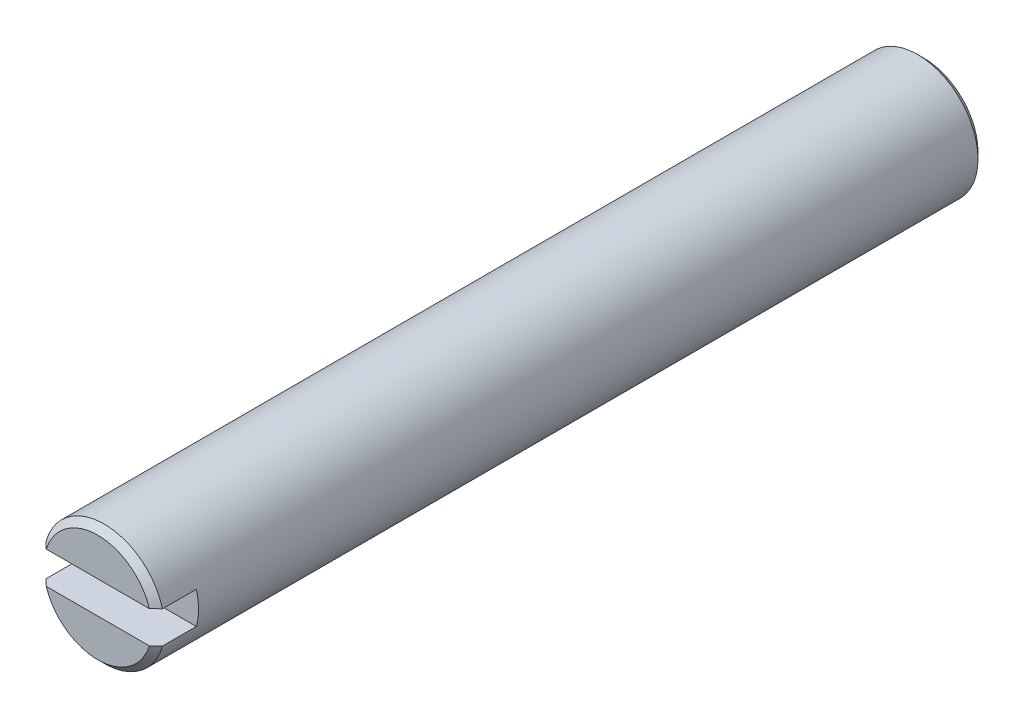
ISO-10303-21;
HEADER;
FILE_DESCRIPTION(('STEP AP214'),'2;1');
FILE_NAME('part.step','',(''),(''),'','','');
FILE_SCHEMA(('AUTOMOTIVE_DESIGN { 1 0 10303 214 1 1 1 1 }'));
ENDSEC;
DATA;
#1=APPLICATION_CONTEXT('core data for automotive mechanical design processes');
#2=APPLICATION_PROTOCOL_DEFINITION('international standard','automotive_design',2000,#1);
#3=PRODUCT_CONTEXT('',#1,'mechanical');
#4=PRODUCT('Part','Part','',(#3));
#5=PRODUCT_RELATED_PRODUCT_CATEGORY('part','',(#4));
#6=PRODUCT_DEFINITION_FORMATION('','',#4);
#7=PRODUCT_DEFINITION_CONTEXT('part definition',#1,'design');
#8=PRODUCT_DEFINITION('design','',#6,#7);
#9=PRODUCT_DEFINITION_SHAPE('','',#8);
#10=(LENGTH_UNIT() NAMED_UNIT(*) SI_UNIT(.MILLI.,.METRE.));
#11=(NAMED_UNIT(*) PLANE_ANGLE_UNIT() SI_UNIT($,.RADIAN.));
#12=(NAMED_UNIT(*) SI_UNIT($,.STERADIAN.) SOLID_ANGLE_UNIT());
#13=UNCERTAINTY_MEASURE_WITH_UNIT(LENGTH_MEASURE(1.E-05),#10,'distance_accuracy_value','');
#14=(GEOMETRIC_REPRESENTATION_CONTEXT(3) GLOBAL_UNCERTAINTY_ASSIGNED_CONTEXT((#13)) GLOBAL_UNIT_ASSIGNED_CONTEXT((#10,
#11,#12)) REPRESENTATION_CONTEXT('',''));
#15=CARTESIAN_POINT('',(0.,0.,0.));
#16=DIRECTION('',(0.,0.,1.));
#17=DIRECTION('',(1.,0.,0.));
#18=AXIS2_PLACEMENT_3D('',#15,#16,#17);
#19=CARTESIAN_POINT('',(0.,0.,65.1002));
#20=DIRECTION('',(0.,0.,1.));
#21=DIRECTION('',(1.,0.,0.));
#22=AXIS2_PLACEMENT_3D('',#19,#20,#21);
#23=PLANE('',#22);
#24=DIRECTION('',(-1.,0.,0.));
#25=VECTOR('',#24,1.);
#26=CARTESIAN_POINT('',(0.,1.27,65.1002));
#27=LINE('',#26,#25);
#28=CARTESIAN_POINT('',(4.06052585880205,1.27,65.1002));
#29=VERTEX_POINT('',#28);
#30=CARTESIAN_POINT('',(-4.06052585880205,1.27,65.1002));
#31=VERTEX_POINT('',#30);
#32=EDGE_CURVE('E132',#29,#31,#27,.T.);
#33=ORIENTED_EDGE('',*,*,#32,.F.);
#34=CARTESIAN_POINT('',(0.,0.,65.1002));
#35=DIRECTION('',(0.,0.,1.));
#36=DIRECTION('',(1.,0.,0.));
#37=AXIS2_PLACEMENT_3D('',#34,#35,#36);
#38=CIRCLE('',#37,4.25450000000001);
#39=EDGE_CURVE('E195',#29,#31,#38,.T.);
#40=ORIENTED_EDGE('',*,*,#39,.T.);
#41=EDGE_LOOP('',(#33,#40));
#42=FACE_BOUND('',#41,.T.);
#43=ADVANCED_FACE('F35',(#42),#23,.T.);
#44=CARTESIAN_POINT('',(0.,0.,65.1002));
#45=DIRECTION('',(0.,0.,-1.));
#46=DIRECTION('',(-1.,0.,0.));
#47=AXIS2_PLACEMENT_3D('',#44,#45,#46);
#48=CYLINDRICAL_SURFACE('',#47,4.7625);
#49=CARTESIAN_POINT('',(0.,0.,0.508000000000008));
#50=DIRECTION('',(0.,0.,1.));
#51=DIRECTION('',(1.,0.,0.));
#52=AXIS2_PLACEMENT_3D('',#49,#50,#51);
#53=CIRCLE('',#52,4.7625);
#54=CARTESIAN_POINT('',(4.7625,0.,0.508000000000008));
#55=VERTEX_POINT('',#54);
#56=EDGE_CURVE('E136',#55,#55,#53,.T.);
#57=ORIENTED_EDGE('',*,*,#56,.T.);
#58=EDGE_LOOP('',(#57));
#59=FACE_BOUND('',#58,.T.);
#60=DIRECTION('',(0.,0.,-1.));
#61=VECTOR('',#60,1.);
#62=CARTESIAN_POINT('',(4.5900442535993,-1.27,65.1002));
#63=LINE('',#62,#61);
#64=CARTESIAN_POINT('',(4.5900442535993,-1.27,61.9252));
#65=VERTEX_POINT('',#64);
#66=CARTESIAN_POINT('',(4.5900442535993,-1.27,64.5922));
#67=VERTEX_POINT('',#66);
#68=EDGE_CURVE('E107',#65,#67,#63,.F.);
#69=ORIENTED_EDGE('',*,*,#68,.T.);
#70=CARTESIAN_POINT('',(0.,0.,64.5922));
#71=DIRECTION('',(0.,0.,1.));
#72=DIRECTION('',(1.,0.,0.));
#73=AXIS2_PLACEMENT_3D('',#70,#71,#72);
#74=CIRCLE('',#73,4.7625);
#75=CARTESIAN_POINT('',(-4.5900442535993,-1.27,64.5922));
#76=VERTEX_POINT('',#75);
#77=EDGE_CURVE('E102',#67,#76,#74,.F.);
#78=ORIENTED_EDGE('',*,*,#77,.T.);
#79=DIRECTION('',(0.,0.,-1.));
#80=VECTOR('',#79,1.);
#81=CARTESIAN_POINT('',(-4.5900442535993,-1.27,65.1002));
#82=LINE('',#81,#80);
#83=CARTESIAN_POINT('',(-4.5900442535993,-1.27,61.9252));
#84=VERTEX_POINT('',#83);
#85=EDGE_CURVE('E94',#76,#84,#82,.T.);
#86=ORIENTED_EDGE('',*,*,#85,.T.);
#87=CARTESIAN_POINT('',(0.,0.,61.9252));
#88=DIRECTION('',(0.,0.,1.));
#89=DIRECTION('',(1.,0.,0.));
#90=AXIS2_PLACEMENT_3D('',#87,#88,#89);
#91=CIRCLE('',#90,4.7625);
#92=CARTESIAN_POINT('',(-4.5900442535993,1.27,61.9252));
#93=VERTEX_POINT('',#92);
#94=EDGE_CURVE('E99',#93,#84,#91,.T.);
#95=ORIENTED_EDGE('',*,*,#94,.F.);
#96=DIRECTION('',(0.,0.,-1.));
#97=VECTOR('',#96,1.);
#98=CARTESIAN_POINT('',(-4.5900442535993,1.27,65.1002));
#99=LINE('',#98,#97);
#100=CARTESIAN_POINT('',(-4.5900442535993,1.27,64.5922));
#101=VERTEX_POINT('',#100);
#102=EDGE_CURVE('E106',#93,#101,#99,.F.);
#103=ORIENTED_EDGE('',*,*,#102,.T.);
#104=CARTESIAN_POINT('',(0.,0.,64.5922));
#105=DIRECTION('',(0.,0.,1.));
#106=DIRECTION('',(1.,0.,0.));
#107=AXIS2_PLACEMENT_3D('',#104,#105,#106);
#108=CIRCLE('',#107,4.7625);
#109=CARTESIAN_POINT('',(4.5900442535993,1.27,64.5922));
#110=VERTEX_POINT('',#109);
#111=EDGE_CURVE('E118',#101,#110,#108,.F.);
#112=ORIENTED_EDGE('',*,*,#111,.T.);
#113=DIRECTION('',(0.,0.,-1.));
#114=VECTOR('',#113,1.);
#115=CARTESIAN_POINT('',(4.5900442535993,1.27,65.1002));
#116=LINE('',#115,#114);
#117=CARTESIAN_POINT('',(4.5900442535993,1.27,61.9252));
#118=VERTEX_POINT('',#117);
#119=EDGE_CURVE('E128',#110,#118,#116,.T.);
#120=ORIENTED_EDGE('',*,*,#119,.T.);
#121=EDGE_CURVE('E119',#65,#118,#91,.T.);
#122=ORIENTED_EDGE('',*,*,#121,.F.);
#123=EDGE_LOOP('',(#69,#78,#86,#95,#103,#112,#120,#122));
#124=FACE_BOUND('',#123,.T.);
#125=ADVANCED_FACE('F97',(#59,#124),#48,.T.);
#126=DIRECTION('',(1.,0.,0.));
#127=VECTOR('',#126,1.);
#128=CARTESIAN_POINT('',(0.,-1.27,65.1002));
#129=LINE('',#128,#127);
#130=CARTESIAN_POINT('',(-4.06052585880205,-1.27,65.1002));
#131=VERTEX_POINT('',#130);
#132=CARTESIAN_POINT('',(4.06052585880205,-1.27,65.1002));
#133=VERTEX_POINT('',#132);
#134=EDGE_CURVE('E130',#131,#133,#129,.T.);
#135=ORIENTED_EDGE('',*,*,#134,.F.);
#136=CARTESIAN_POINT('',(0.,0.,65.1002));
#137=DIRECTION('',(0.,0.,1.));
#138=DIRECTION('',(1.,0.,0.));
#139=AXIS2_PLACEMENT_3D('',#136,#137,#138);
#140=CIRCLE('',#139,4.25450000000002);
#141=EDGE_CURVE('E142',#131,#133,#140,.T.);
#142=ORIENTED_EDGE('',*,*,#141,.T.);
#143=EDGE_LOOP('',(#135,#142));
#144=FACE_BOUND('',#143,.T.);
#145=ADVANCED_FACE('F169',(#144),#23,.T.);
#146=CARTESIAN_POINT('',(0.,0.,0.));
#147=DIRECTION('',(0.,0.,1.));
#148=DIRECTION('',(1.,0.,0.));
#149=AXIS2_PLACEMENT_3D('',#146,#147,#148);
#150=PLANE('',#149);
#151=CARTESIAN_POINT('',(0.,0.,0.));
#152=DIRECTION('',(0.,0.,1.));
#153=DIRECTION('',(1.,0.,0.));
#154=AXIS2_PLACEMENT_3D('',#151,#152,#153);
#155=CIRCLE('',#154,4.25449999999999);
#156=CARTESIAN_POINT('',(4.25449999999999,0.,0.));
#157=VERTEX_POINT('',#156);
#158=EDGE_CURVE('E139',#157,#157,#155,.F.);
#159=ORIENTED_EDGE('',*,*,#158,.T.);
#160=EDGE_LOOP('',(#159));
#161=FACE_BOUND('',#160,.T.);
#162=ADVANCED_FACE('F173',(#161),#150,.F.);
#163=CARTESIAN_POINT('',(0.,0.,61.9252));
#164=DIRECTION('',(0.,0.,1.));
#165=DIRECTION('',(1.,0.,0.));
#166=AXIS2_PLACEMENT_3D('',#163,#164,#165);
#167=PLANE('',#166);
#168=DIRECTION('',(-1.,0.,0.));
#169=VECTOR('',#168,1.);
#170=CARTESIAN_POINT('',(4.7625,1.27,61.9252));
#171=LINE('',#170,#169);
#172=EDGE_CURVE('E117',#118,#93,#171,.T.);
#173=ORIENTED_EDGE('',*,*,#172,.T.);
#174=ORIENTED_EDGE('',*,*,#94,.T.);
#175=DIRECTION('',(1.,0.,0.));
#176=VECTOR('',#175,1.);
#177=CARTESIAN_POINT('',(-4.7625,-1.27,61.9252));
#178=LINE('',#177,#176);
#179=EDGE_CURVE('E114',#84,#65,#178,.T.);
#180=ORIENTED_EDGE('',*,*,#179,.T.);
#181=ORIENTED_EDGE('',*,*,#121,.T.);
#182=EDGE_LOOP('',(#173,#174,#180,#181));
#183=FACE_BOUND('',#182,.T.);
#184=ADVANCED_FACE('F112',(#183),#167,.T.);
#185=CARTESIAN_POINT('',(4.7625,1.27,61.9252));
#186=DIRECTION('',(0.,1.,0.));
#187=DIRECTION('',(-1.,0.,0.));
#188=AXIS2_PLACEMENT_3D('',#185,#186,#187);
#189=PLANE('',#188);
#190=ORIENTED_EDGE('',*,*,#32,.T.);
#191=CARTESIAN_POINT('',(-4.06052585880205,1.27,65.1002));
#192=CARTESIAN_POINT('',(-4.14898508513309,1.27,65.0157482118747));
#193=CARTESIAN_POINT('',(-4.23734123487492,1.27,64.9311889809343));
#194=CARTESIAN_POINT('',(-4.41384736643957,1.27,64.7618556475651));
#195=CARTESIAN_POINT('',(-4.50199734829683,1.27,64.6770815451722));
#196=CARTESIAN_POINT('',(-4.59004425359931,1.27,64.5922));
#197=B_SPLINE_CURVE_WITH_KNOTS('',3,(#191,#192,#193,#194,#195,#196),.UNSPECIFIED.,.F.,.F.,(4,2,
4),(0.,0.366897335244926,0.733794609208244),.UNSPECIFIED.);
#198=EDGE_CURVE('E11',#31,#101,#197,.T.);
#199=ORIENTED_EDGE('',*,*,#198,.T.);
#200=ORIENTED_EDGE('',*,*,#102,.F.);
#201=ORIENTED_EDGE('',*,*,#172,.F.);
#202=ORIENTED_EDGE('',*,*,#119,.F.);
#203=CARTESIAN_POINT('',(4.5900442535993,1.27,64.5922));
#204=CARTESIAN_POINT('',(4.50199734829682,1.27,64.6770815451722));
#205=CARTESIAN_POINT('',(4.41384736643957,1.27,64.7618556475651));
#206=CARTESIAN_POINT('',(4.23734123487492,1.27,64.9311889809343));
#207=CARTESIAN_POINT('',(4.14898508513309,1.27,65.0157482118747));
#208=CARTESIAN_POINT('',(4.06052585880205,1.27,65.1002));
#209=B_SPLINE_CURVE_WITH_KNOTS('',3,(#203,#204,#205,#206,#207,#208),.UNSPECIFIED.,.F.,.F.,(4,2,
4),(0.,0.366897273963318,0.733794609208243),.UNSPECIFIED.);
#210=EDGE_CURVE('E50',#110,#29,#209,.T.);
#211=ORIENTED_EDGE('',*,*,#210,.T.);
#212=EDGE_LOOP('',(#190,#199,#200,#201,#202,#211));
#213=FACE_BOUND('',#212,.T.);
#214=ADVANCED_FACE('F166',(#213),#189,.F.);
#215=CARTESIAN_POINT('',(-4.7625,-1.27,61.9252));
#216=DIRECTION('',(0.,-1.,0.));
#217=DIRECTION('',(1.,0.,0.));
#218=AXIS2_PLACEMENT_3D('',#215,#216,#217);
#219=PLANE('',#218);
#220=ORIENTED_EDGE('',*,*,#134,.T.);
#221=CARTESIAN_POINT('',(4.06052585880205,-1.27,65.1002));
#222=CARTESIAN_POINT('',(4.14898508513309,-1.27,65.0157482118747));
#223=CARTESIAN_POINT('',(4.23734123487492,-1.27,64.9311889809343));
#224=CARTESIAN_POINT('',(4.41384736643957,-1.27,64.7618556475651));
#225=CARTESIAN_POINT('',(4.50199734829682,-1.27,64.6770815451722));
#226=CARTESIAN_POINT('',(4.5900442535993,-1.27,64.5922));
#227=B_SPLINE_CURVE_WITH_KNOTS('',3,(#221,#222,#223,#224,#225,#226),.UNSPECIFIED.,.F.,.F.,(4,2,
4),(0.,0.366897335244926,0.733794609208243),.UNSPECIFIED.);
#228=EDGE_CURVE('E152',#133,#67,#227,.T.);
#229=ORIENTED_EDGE('',*,*,#228,.T.);
#230=ORIENTED_EDGE('',*,*,#68,.F.);
#231=ORIENTED_EDGE('',*,*,#179,.F.);
#232=ORIENTED_EDGE('',*,*,#85,.F.);
#233=CARTESIAN_POINT('',(-4.5900442535993,-1.27,64.5922));
#234=CARTESIAN_POINT('',(-4.50199734829682,-1.27,64.6770815451722));
#235=CARTESIAN_POINT('',(-4.41384736643957,-1.27,64.7618556475651));
#236=CARTESIAN_POINT('',(-4.23734123487492,-1.27,64.9311889809343));
#237=CARTESIAN_POINT('',(-4.14898508513309,-1.27,65.0157482118747));
#238=CARTESIAN_POINT('',(-4.06052585880205,-1.27,65.1002));
#239=B_SPLINE_CURVE_WITH_KNOTS('',3,(#233,#234,#235,#236,#237,#238),.UNSPECIFIED.,.F.,.F.,(4,2,
4),(0.,0.366897273963317,0.733794609208243),.UNSPECIFIED.);
#240=EDGE_CURVE('E145',#76,#131,#239,.T.);
#241=ORIENTED_EDGE('',*,*,#240,.T.);
#242=EDGE_LOOP('',(#220,#229,#230,#231,#232,#241));
#243=FACE_BOUND('',#242,.T.);
#244=ADVANCED_FACE('F122',(#243),#219,.F.);
#245=CARTESIAN_POINT('',(0.,0.,0.508000000000008));
#246=DIRECTION('',(0.,0.,1.));
#247=DIRECTION('',(1.,0.,0.));
#248=AXIS2_PLACEMENT_3D('',#245,#246,#247);
#249=CONICAL_SURFACE('',#248,4.7625,0.785398163397453);
#250=ORIENTED_EDGE('',*,*,#158,.F.);
#251=EDGE_LOOP('',(#250));
#252=FACE_BOUND('',#251,.T.);
#253=ORIENTED_EDGE('',*,*,#56,.F.);
#254=EDGE_LOOP('',(#253));
#255=FACE_BOUND('',#254,.T.);
#256=ADVANCED_FACE('F165',(#252,#255),#249,.T.);
#257=CARTESIAN_POINT('',(0.,0.,65.1002));
#258=DIRECTION('',(0.,0.,-1.));
#259=DIRECTION('',(-1.,0.,0.));
#260=AXIS2_PLACEMENT_3D('',#257,#258,#259);
#261=CONICAL_SURFACE('',#260,4.25450000000002,0.785398163397453);
#262=ORIENTED_EDGE('',*,*,#240,.F.);
#263=ORIENTED_EDGE('',*,*,#77,.F.);
#264=ORIENTED_EDGE('',*,*,#228,.F.);
#265=ORIENTED_EDGE('',*,*,#141,.F.);
#266=EDGE_LOOP('',(#262,#263,#264,#265));
#267=FACE_BOUND('',#266,.T.);
#268=ADVANCED_FACE('F159',(#267),#261,.T.);
#269=CARTESIAN_POINT('',(0.,0.,65.1002));
#270=DIRECTION('',(0.,0.,-1.));
#271=DIRECTION('',(-1.,0.,0.));
#272=AXIS2_PLACEMENT_3D('',#269,#270,#271);
#273=CONICAL_SURFACE('',#272,4.25450000000002,0.785398163397453);
#274=ORIENTED_EDGE('',*,*,#210,.F.);
#275=ORIENTED_EDGE('',*,*,#111,.F.);
#276=ORIENTED_EDGE('',*,*,#198,.F.);
#277=ORIENTED_EDGE('',*,*,#39,.F.);
#278=EDGE_LOOP('',(#274,#275,#276,#277));
#279=FACE_BOUND('',#278,.T.);
#280=ADVANCED_FACE('F38',(#279),#273,.T.);
#281=CLOSED_SHELL('',(#43,#125,#145,#162,#184,#214,#244,#256,#268,#280));
#282=MANIFOLD_SOLID_BREP('B2',#281);
#283=ADVANCED_BREP_SHAPE_REPRESENTATION('',(#18,#282),#14);
#284=SHAPE_DEFINITION_REPRESENTATION(#9,#283);
ENDSEC;
END-ISO-10303-21;
